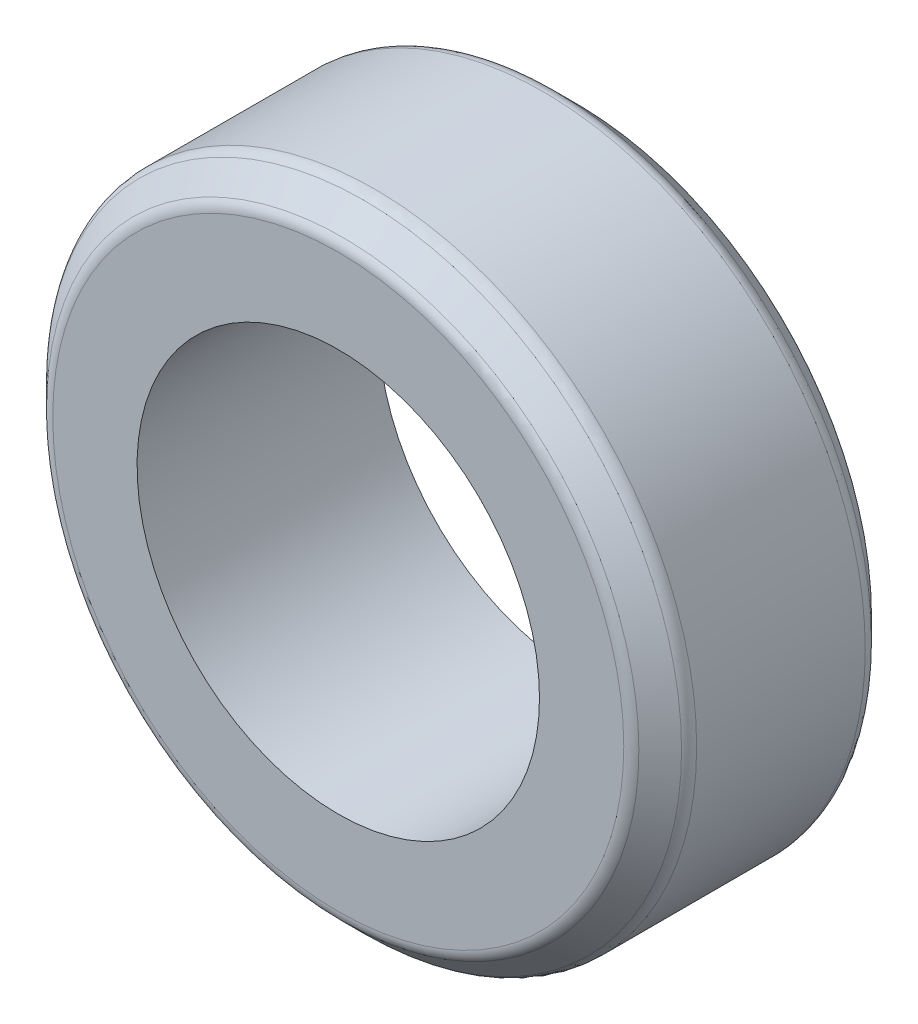
ISO-10303-21;
HEADER;
FILE_DESCRIPTION(('STEP AP214'),'2;1');
FILE_NAME('part.step','',(''),(''),'','','');
FILE_SCHEMA(('AUTOMOTIVE_DESIGN { 1 0 10303 214 1 1 1 1 }'));
ENDSEC;
DATA;
#1=APPLICATION_CONTEXT('core data for automotive mechanical design processes');
#2=APPLICATION_PROTOCOL_DEFINITION('international standard','automotive_design',2000,#1);
#3=PRODUCT_CONTEXT('',#1,'mechanical');
#4=PRODUCT('Part','Part','',(#3));
#5=PRODUCT_RELATED_PRODUCT_CATEGORY('part','',(#4));
#6=PRODUCT_DEFINITION_FORMATION('','',#4);
#7=PRODUCT_DEFINITION_CONTEXT('part definition',#1,'design');
#8=PRODUCT_DEFINITION('design','',#6,#7);
#9=PRODUCT_DEFINITION_SHAPE('','',#8);
#10=(LENGTH_UNIT() NAMED_UNIT(*) SI_UNIT(.MILLI.,.METRE.));
#11=(NAMED_UNIT(*) PLANE_ANGLE_UNIT() SI_UNIT($,.RADIAN.));
#12=(NAMED_UNIT(*) SI_UNIT($,.STERADIAN.) SOLID_ANGLE_UNIT());
#13=UNCERTAINTY_MEASURE_WITH_UNIT(LENGTH_MEASURE(1.E-05),#10,'distance_accuracy_value','');
#14=(GEOMETRIC_REPRESENTATION_CONTEXT(3) GLOBAL_UNCERTAINTY_ASSIGNED_CONTEXT((#13)) GLOBAL_UNIT_ASSIGNED_CONTEXT((#10,
#11,#12)) REPRESENTATION_CONTEXT('',''));
#15=CARTESIAN_POINT('',(0.,0.,0.));
#16=DIRECTION('',(0.,0.,1.));
#17=DIRECTION('',(1.,0.,0.));
#18=AXIS2_PLACEMENT_3D('',#15,#16,#17);
#19=CARTESIAN_POINT('',(0.,0.,-66.675));
#20=DIRECTION('',(0.,0.,1.));
#21=DIRECTION('',(1.,0.,0.));
#22=AXIS2_PLACEMENT_3D('',#19,#20,#21);
#23=TOROIDAL_SURFACE('',#22,180.204615818396,9.525);
#24=CARTESIAN_POINT('',(0.,0.,-76.2));
#25=DIRECTION('',(0.,0.,1.));
#26=DIRECTION('',(1.,0.,0.));
#27=AXIS2_PLACEMENT_3D('',#24,#25,#26);
#28=CIRCLE('',#27,180.204615818396);
#29=CARTESIAN_POINT('',(180.204615818396,0.,-76.2));
#30=VERTEX_POINT('',#29);
#31=EDGE_CURVE('E8',#30,#30,#28,.T.);
#32=ORIENTED_EDGE('',*,*,#31,.T.);
#33=EDGE_LOOP('',(#32));
#34=FACE_BOUND('',#33,.T.);
#35=CARTESIAN_POINT('',(0.,0.,-73.4101920908019));
#36=DIRECTION('',(0.,0.,-1.));
#37=DIRECTION('',(0.,-1.,0.));
#38=AXIS2_PLACEMENT_3D('',#35,#36,#37);
#39=CIRCLE('',#38,186.939807909198);
#40=CARTESIAN_POINT('',(0.,-186.939807909198,-73.4101920908019));
#41=VERTEX_POINT('',#40);
#42=EDGE_CURVE('E21',#41,#41,#39,.T.);
#43=ORIENTED_EDGE('',*,*,#42,.T.);
#44=EDGE_LOOP('',(#43));
#45=FACE_BOUND('',#44,.T.);
#46=ADVANCED_FACE('F13',(#34,#45),#23,.T.);
#47=CARTESIAN_POINT('',(0.,0.,-66.675));
#48=DIRECTION('',(0.,0.,1.));
#49=DIRECTION('',(1.,0.,0.));
#50=AXIS2_PLACEMENT_3D('',#47,#48,#49);
#51=CONICAL_SURFACE('',#50,193.675,0.785398163397449);
#52=CARTESIAN_POINT('',(0.,0.,-59.9398079091981));
#53=DIRECTION('',(0.,0.,1.));
#54=DIRECTION('',(1.,0.,0.));
#55=AXIS2_PLACEMENT_3D('',#52,#53,#54);
#56=CIRCLE('',#55,200.410192090802);
#57=CARTESIAN_POINT('',(200.410192090802,0.,-59.9398079091981));
#58=VERTEX_POINT('',#57);
#59=EDGE_CURVE('E29',#58,#58,#56,.T.);
#60=ORIENTED_EDGE('',*,*,#59,.F.);
#61=EDGE_LOOP('',(#60));
#62=FACE_BOUND('',#61,.T.);
#63=ORIENTED_EDGE('',*,*,#42,.F.);
#64=EDGE_LOOP('',(#63));
#65=FACE_BOUND('',#64,.T.);
#66=ADVANCED_FACE('F72',(#62,#65),#51,.T.);
#67=CARTESIAN_POINT('',(0.,0.,-76.2));
#68=DIRECTION('',(0.,0.,-1.));
#69=DIRECTION('',(-1.,0.,0.));
#70=AXIS2_PLACEMENT_3D('',#67,#68,#69);
#71=PLANE('',#70);
#72=CARTESIAN_POINT('',(0.,0.,-76.2));
#73=DIRECTION('',(0.,0.,1.));
#74=DIRECTION('',(1.,0.,0.));
#75=AXIS2_PLACEMENT_3D('',#72,#73,#74);
#76=CIRCLE('',#75,127.);
#77=CARTESIAN_POINT('',(127.,0.,-76.2));
#78=VERTEX_POINT('',#77);
#79=EDGE_CURVE('E26',#78,#78,#76,.T.);
#80=ORIENTED_EDGE('',*,*,#79,.T.);
#81=EDGE_LOOP('',(#80));
#82=FACE_BOUND('',#81,.T.);
#83=ORIENTED_EDGE('',*,*,#31,.F.);
#84=EDGE_LOOP('',(#83));
#85=FACE_BOUND('',#84,.T.);
#86=ADVANCED_FACE('F77',(#82,#85),#71,.T.);
#87=CARTESIAN_POINT('',(0.,0.,-53.2046158183963));
#88=DIRECTION('',(0.,0.,-1.));
#89=DIRECTION('',(0.,-1.,0.));
#90=AXIS2_PLACEMENT_3D('',#87,#88,#89);
#91=TOROIDAL_SURFACE('',#90,193.675,9.525);
#92=CARTESIAN_POINT('',(0.,0.,-53.2046158183963));
#93=DIRECTION('',(0.,0.,-1.));
#94=DIRECTION('',(0.,-1.,0.));
#95=AXIS2_PLACEMENT_3D('',#92,#93,#94);
#96=CIRCLE('',#95,203.2);
#97=CARTESIAN_POINT('',(0.,-203.2,-53.2046158183963));
#98=VERTEX_POINT('',#97);
#99=EDGE_CURVE('E32',#98,#98,#96,.T.);
#100=ORIENTED_EDGE('',*,*,#99,.T.);
#101=EDGE_LOOP('',(#100));
#102=FACE_BOUND('',#101,.T.);
#103=ORIENTED_EDGE('',*,*,#59,.T.);
#104=EDGE_LOOP('',(#103));
#105=FACE_BOUND('',#104,.T.);
#106=ADVANCED_FACE('F66',(#102,#105),#91,.T.);
#107=CARTESIAN_POINT('',(0.,0.,0.));
#108=DIRECTION('',(0.,0.,1.));
#109=DIRECTION('',(1.,0.,0.));
#110=AXIS2_PLACEMENT_3D('',#107,#108,#109);
#111=CYLINDRICAL_SURFACE('',#110,203.2);
#112=CARTESIAN_POINT('',(0.,0.,53.2046158183963));
#113=DIRECTION('',(0.,0.,1.));
#114=DIRECTION('',(1.,0.,0.));
#115=AXIS2_PLACEMENT_3D('',#112,#113,#114);
#116=CIRCLE('',#115,203.2);
#117=CARTESIAN_POINT('',(203.2,0.,53.2046158183963));
#118=VERTEX_POINT('',#117);
#119=EDGE_CURVE('E38',#118,#118,#116,.T.);
#120=ORIENTED_EDGE('',*,*,#119,.F.);
#121=EDGE_LOOP('',(#120));
#122=FACE_BOUND('',#121,.T.);
#123=ORIENTED_EDGE('',*,*,#99,.F.);
#124=EDGE_LOOP('',(#123));
#125=FACE_BOUND('',#124,.T.);
#126=ADVANCED_FACE('F59',(#122,#125),#111,.T.);
#127=CARTESIAN_POINT('',(0.,0.,66.675));
#128=DIRECTION('',(0.,0.,-1.));
#129=DIRECTION('',(0.,-1.,0.));
#130=AXIS2_PLACEMENT_3D('',#127,#128,#129);
#131=TOROIDAL_SURFACE('',#130,180.204615818396,9.525);
#132=CARTESIAN_POINT('',(0.,0.,76.2));
#133=DIRECTION('',(0.,0.,-1.));
#134=DIRECTION('',(0.,-1.,0.));
#135=AXIS2_PLACEMENT_3D('',#132,#133,#134);
#136=CIRCLE('',#135,180.204615818396);
#137=CARTESIAN_POINT('',(0.,-180.204615818396,76.2));
#138=VERTEX_POINT('',#137);
#139=EDGE_CURVE('E33',#138,#138,#136,.T.);
#140=ORIENTED_EDGE('',*,*,#139,.T.);
#141=EDGE_LOOP('',(#140));
#142=FACE_BOUND('',#141,.T.);
#143=CARTESIAN_POINT('',(0.,0.,73.4101920908019));
#144=DIRECTION('',(0.,0.,1.));
#145=DIRECTION('',(1.,0.,0.));
#146=AXIS2_PLACEMENT_3D('',#143,#144,#145);
#147=CIRCLE('',#146,186.939807909198);
#148=CARTESIAN_POINT('',(186.939807909198,0.,73.4101920908019));
#149=VERTEX_POINT('',#148);
#150=EDGE_CURVE('E44',#149,#149,#147,.T.);
#151=ORIENTED_EDGE('',*,*,#150,.T.);
#152=EDGE_LOOP('',(#151));
#153=FACE_BOUND('',#152,.T.);
#154=ADVANCED_FACE('F55',(#142,#153),#131,.T.);
#155=CARTESIAN_POINT('',(0.,0.,66.675));
#156=DIRECTION('',(0.,0.,-1.));
#157=DIRECTION('',(0.,-1.,0.));
#158=AXIS2_PLACEMENT_3D('',#155,#156,#157);
#159=CONICAL_SURFACE('',#158,193.675,0.785398163397449);
#160=CARTESIAN_POINT('',(0.,0.,59.9398079091981));
#161=DIRECTION('',(0.,0.,-1.));
#162=DIRECTION('',(0.,-1.,0.));
#163=AXIS2_PLACEMENT_3D('',#160,#161,#162);
#164=CIRCLE('',#163,200.410192090802);
#165=CARTESIAN_POINT('',(0.,-200.410192090802,59.9398079091981));
#166=VERTEX_POINT('',#165);
#167=EDGE_CURVE('E41',#166,#166,#164,.T.);
#168=ORIENTED_EDGE('',*,*,#167,.F.);
#169=EDGE_LOOP('',(#168));
#170=FACE_BOUND('',#169,.T.);
#171=ORIENTED_EDGE('',*,*,#150,.F.);
#172=EDGE_LOOP('',(#171));
#173=FACE_BOUND('',#172,.T.);
#174=ADVANCED_FACE('F51',(#170,#173),#159,.T.);
#175=CARTESIAN_POINT('',(0.,0.,76.2));
#176=DIRECTION('',(0.,0.,-1.));
#177=DIRECTION('',(-1.,0.,0.));
#178=AXIS2_PLACEMENT_3D('',#175,#176,#177);
#179=PLANE('',#178);
#180=CARTESIAN_POINT('',(0.,0.,76.2));
#181=DIRECTION('',(0.,0.,-1.));
#182=DIRECTION('',(0.,-1.,0.));
#183=AXIS2_PLACEMENT_3D('',#180,#181,#182);
#184=CIRCLE('',#183,127.);
#185=CARTESIAN_POINT('',(0.,-127.,76.2));
#186=VERTEX_POINT('',#185);
#187=EDGE_CURVE('E17',#186,#186,#184,.T.);
#188=ORIENTED_EDGE('',*,*,#187,.T.);
#189=EDGE_LOOP('',(#188));
#190=FACE_BOUND('',#189,.T.);
#191=ORIENTED_EDGE('',*,*,#139,.F.);
#192=EDGE_LOOP('',(#191));
#193=FACE_BOUND('',#192,.T.);
#194=ADVANCED_FACE('F54',(#190,#193),#179,.F.);
#195=CARTESIAN_POINT('',(0.,0.,53.2046158183963));
#196=DIRECTION('',(0.,0.,1.));
#197=DIRECTION('',(1.,0.,0.));
#198=AXIS2_PLACEMENT_3D('',#195,#196,#197);
#199=TOROIDAL_SURFACE('',#198,193.675,9.525);
#200=ORIENTED_EDGE('',*,*,#119,.T.);
#201=EDGE_LOOP('',(#200));
#202=FACE_BOUND('',#201,.T.);
#203=ORIENTED_EDGE('',*,*,#167,.T.);
#204=EDGE_LOOP('',(#203));
#205=FACE_BOUND('',#204,.T.);
#206=ADVANCED_FACE('F49',(#202,#205),#199,.T.);
#207=CARTESIAN_POINT('',(0.,0.,0.));
#208=DIRECTION('',(0.,0.,1.));
#209=DIRECTION('',(1.,0.,0.));
#210=AXIS2_PLACEMENT_3D('',#207,#208,#209);
#211=CYLINDRICAL_SURFACE('',#210,127.);
#212=ORIENTED_EDGE('',*,*,#79,.F.);
#213=EDGE_LOOP('',(#212));
#214=FACE_BOUND('',#213,.T.);
#215=ORIENTED_EDGE('',*,*,#187,.F.);
#216=EDGE_LOOP('',(#215));
#217=FACE_BOUND('',#216,.T.);
#218=ADVANCED_FACE('F15',(#214,#217),#211,.F.);
#219=CLOSED_SHELL('',(#46,#66,#86,#106,#126,#154,#174,#194,#206,#218));
#220=MANIFOLD_SOLID_BREP('B1',#219);
#221=ADVANCED_BREP_SHAPE_REPRESENTATION('',(#18,#220),#14);
#222=SHAPE_DEFINITION_REPRESENTATION(#9,#221);
ENDSEC;
END-ISO-10303-21;
